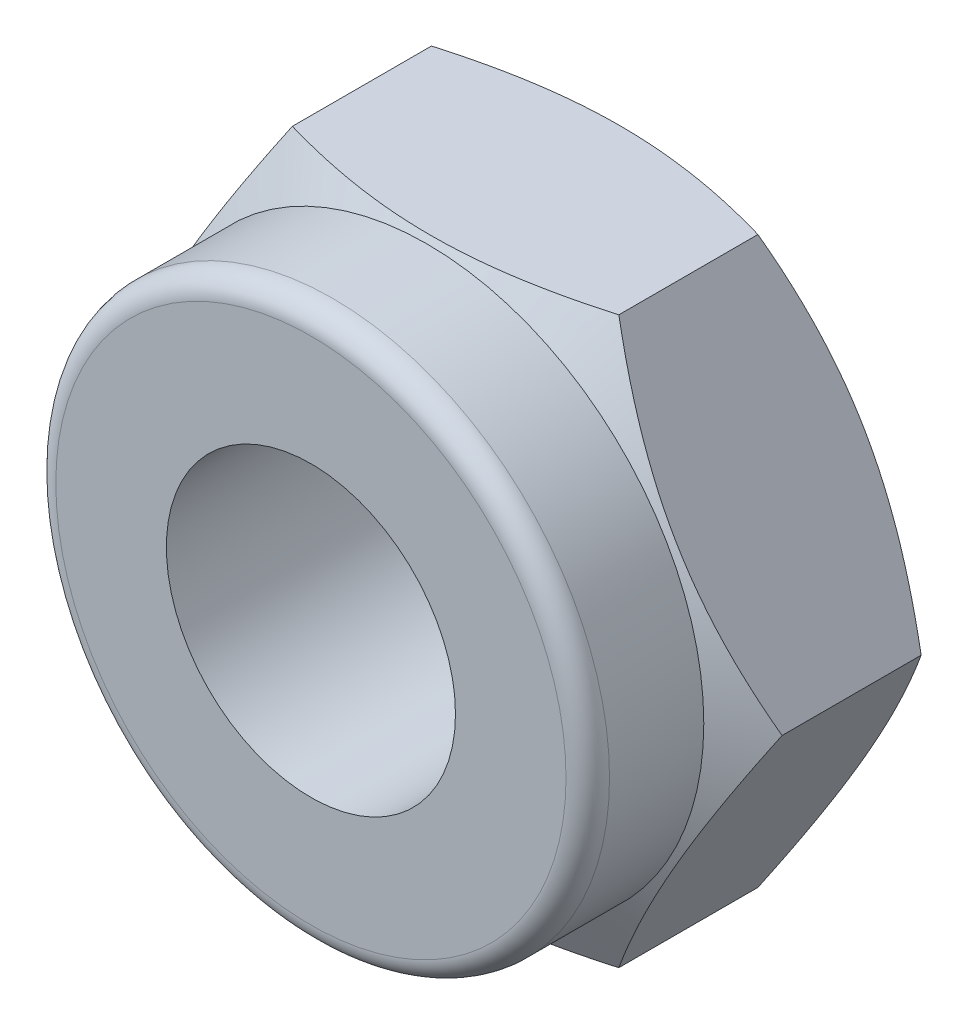
ISO-10303-21;
HEADER;
FILE_DESCRIPTION(('STEP AP214'),'2;1');
FILE_NAME('part.step','',(''),(''),'','','');
FILE_SCHEMA(('AUTOMOTIVE_DESIGN { 1 0 10303 214 1 1 1 1 }'));
ENDSEC;
DATA;
#1=APPLICATION_CONTEXT('core data for automotive mechanical design processes');
#2=APPLICATION_PROTOCOL_DEFINITION('international standard','automotive_design',2000,#1);
#3=PRODUCT_CONTEXT('',#1,'mechanical');
#4=PRODUCT('Part','Part','',(#3));
#5=PRODUCT_RELATED_PRODUCT_CATEGORY('part','',(#4));
#6=PRODUCT_DEFINITION_FORMATION('','',#4);
#7=PRODUCT_DEFINITION_CONTEXT('part definition',#1,'design');
#8=PRODUCT_DEFINITION('design','',#6,#7);
#9=PRODUCT_DEFINITION_SHAPE('','',#8);
#10=(LENGTH_UNIT() NAMED_UNIT(*) SI_UNIT(.MILLI.,.METRE.));
#11=(NAMED_UNIT(*) PLANE_ANGLE_UNIT() SI_UNIT($,.RADIAN.));
#12=(NAMED_UNIT(*) SI_UNIT($,.STERADIAN.) SOLID_ANGLE_UNIT());
#13=UNCERTAINTY_MEASURE_WITH_UNIT(LENGTH_MEASURE(1.E-05),#10,'distance_accuracy_value','');
#14=(GEOMETRIC_REPRESENTATION_CONTEXT(3) GLOBAL_UNCERTAINTY_ASSIGNED_CONTEXT((#13)) GLOBAL_UNIT_ASSIGNED_CONTEXT((#10,
#11,#12)) REPRESENTATION_CONTEXT('',''));
#15=CARTESIAN_POINT('',(0.,0.,0.));
#16=DIRECTION('',(0.,0.,1.));
#17=DIRECTION('',(1.,0.,0.));
#18=AXIS2_PLACEMENT_3D('',#15,#16,#17);
#19=CARTESIAN_POINT('',(0.,0.,4.35));
#20=DIRECTION('',(0.,0.,-1.));
#21=DIRECTION('',(-1.,0.,0.));
#22=AXIS2_PLACEMENT_3D('',#19,#20,#21);
#23=CYLINDRICAL_SURFACE('',#22,6.365);
#24=CARTESIAN_POINT('',(0.,0.,1.85));
#25=DIRECTION('',(0.,0.,1.));
#26=DIRECTION('',(1.,0.,0.));
#27=AXIS2_PLACEMENT_3D('',#24,#25,#26);
#28=CIRCLE('',#27,6.365);
#29=CARTESIAN_POINT('',(6.365,0.,1.85));
#30=VERTEX_POINT('',#29);
#31=EDGE_CURVE('E185',#30,#30,#28,.T.);
#32=ORIENTED_EDGE('',*,*,#31,.F.);
#33=EDGE_LOOP('',(#32));
#34=FACE_BOUND('',#33,.T.);
#35=CARTESIAN_POINT('',(0.,0.,-0.317542648054294));
#36=DIRECTION('',(0.,0.,-1.));
#37=DIRECTION('',(1.,0.,0.));
#38=AXIS2_PLACEMENT_3D('',#35,#36,#37);
#39=CIRCLE('',#38,6.365);
#40=CARTESIAN_POINT('',(6.365,0.,-0.317542648054294));
#41=VERTEX_POINT('',#40);
#42=EDGE_CURVE('E188',#41,#41,#39,.T.);
#43=ORIENTED_EDGE('',*,*,#42,.F.);
#44=EDGE_LOOP('',(#43));
#45=FACE_BOUND('',#44,.T.);
#46=ADVANCED_FACE('F17',(#34,#45),#23,.T.);
#47=CARTESIAN_POINT('',(0.,0.,1.85));
#48=DIRECTION('',(0.,0.,1.));
#49=DIRECTION('',(1.,0.,0.));
#50=AXIS2_PLACEMENT_3D('',#47,#48,#49);
#51=TOROIDAL_SURFACE('',#50,5.865,0.5);
#52=ORIENTED_EDGE('',*,*,#31,.T.);
#53=EDGE_LOOP('',(#52));
#54=FACE_BOUND('',#53,.T.);
#55=CARTESIAN_POINT('',(0.,0.,2.35));
#56=DIRECTION('',(0.,0.,-1.));
#57=DIRECTION('',(1.,0.,0.));
#58=AXIS2_PLACEMENT_3D('',#55,#56,#57);
#59=CIRCLE('',#58,5.865);
#60=CARTESIAN_POINT('',(-5.865,0.,2.35));
#61=VERTEX_POINT('',#60);
#62=CARTESIAN_POINT('',(5.865,0.,2.35));
#63=VERTEX_POINT('',#62);
#64=EDGE_CURVE('E75',#61,#63,#59,.F.);
#65=ORIENTED_EDGE('',*,*,#64,.F.);
#66=CARTESIAN_POINT('',(0.,0.,2.35));
#67=DIRECTION('',(0.,0.,-1.));
#68=DIRECTION('',(-1.,0.,0.));
#69=AXIS2_PLACEMENT_3D('',#66,#67,#68);
#70=CIRCLE('',#69,5.865);
#71=EDGE_CURVE('E191',#63,#61,#70,.F.);
#72=ORIENTED_EDGE('',*,*,#71,.F.);
#73=EDGE_LOOP('',(#65,#72));
#74=FACE_BOUND('',#73,.T.);
#75=ADVANCED_FACE('F108',(#54,#74),#51,.T.);
#76=CARTESIAN_POINT('',(0.,0.,-0.97999251121531));
#77=DIRECTION('',(0.,0.,-1.));
#78=DIRECTION('',(-1.,0.,0.));
#79=AXIS2_PLACEMENT_3D('',#76,#77,#78);
#80=CONICAL_SURFACE('',#79,7.51239682046193,1.0471975511966);
#81=CARTESIAN_POINT('',(7.50555349946514,0.,-0.976041517995662));
#82=CARTESIAN_POINT('',(7.42306413225731,-0.142875775088176,-0.928425447547227));
#83=CARTESIAN_POINT('',(7.34026720585395,-0.286284258329331,-0.882970550055043));
#84=CARTESIAN_POINT('',(7.17400096468323,-0.574265835620523,-0.796978304075957));
#85=CARTESIAN_POINT('',(7.09053137629194,-0.718839403601101,-0.756443076940983));
#86=CARTESIAN_POINT('',(6.83878625276799,-1.15487474810228,-0.643012619628592));
#87=CARTESIAN_POINT('',(6.66951702604567,-1.44805764894324,-0.578495682867198));
#88=CARTESIAN_POINT('',(6.41620872846852,-1.88680049032564,-0.502843782974544));
#89=CARTESIAN_POINT('',(6.33292644227507,-2.03104964138317,-0.48129310542054));
#90=CARTESIAN_POINT('',(6.16598561364301,-2.32019963843156,-0.445156633633839));
#91=CARTESIAN_POINT('',(6.08232710510691,-2.46510042570152,-0.430570224040223));
#92=CARTESIAN_POINT('',(5.91486483881928,-2.75515357926232,-0.408734025939752));
#93=CARTESIAN_POINT('',(5.83106135447214,-2.90030547200287,-0.401475912268133));
#94=CARTESIAN_POINT('',(5.66338165892069,-3.19073522409566,-0.394444145267347));
#95=CARTESIAN_POINT('',(5.57950545004408,-3.33601307941621,-0.394670260634795));
#96=CARTESIAN_POINT('',(5.34972638911939,-3.73400208745323,-0.405576488157031));
#97=CARTESIAN_POINT('',(5.20389879784904,-3.98658288467888,-0.423875958247116));
#98=CARTESIAN_POINT('',(4.91321216353889,-4.49006690438526,-0.481897477157326));
#99=CARTESIAN_POINT('',(4.76835414237743,-4.74096835692078,-0.521639346886367));
#100=CARTESIAN_POINT('',(4.47708276744823,-5.24546517708861,-0.620980029139186));
#101=CARTESIAN_POINT('',(4.33070615631823,-5.49899690460551,-0.680999630839513));
#102=CARTESIAN_POINT('',(4.04013550251678,-6.00228004017814,-0.817218966611441));
#103=CARTESIAN_POINT('',(3.89593774018532,-6.25203789087397,-0.893386714735364));
#104=CARTESIAN_POINT('',(3.75277674973258,-6.5,-0.976041517995661));
#105=B_SPLINE_CURVE_WITH_KNOTS('',3,(#81,#82,#83,#84,#85,#86,#87,#88,#89,#90,#91,#92,#93,#94,
#95,#96,#97,#98,#99,#100,#101,#102,#103,#104),.UNSPECIFIED.,.F.,.F.,(4,2,2,2,2,2,2,2,2,2,2,4),
(0.,0.515097151807923,1.03041562924707,2.0631934970254,2.56693469263121,3.07063136955385,
3.57375518587235,4.07686345294286,4.95263085757859,5.82920919385675,6.72522583711309,
7.61948397794854),.UNSPECIFIED.);
#106=CARTESIAN_POINT('',(7.50555349946513,0.,-0.976041517995657));
#107=VERTEX_POINT('',#106);
#108=CARTESIAN_POINT('',(3.75277674973258,-6.5,-0.976041517995662));
#109=VERTEX_POINT('',#108);
#110=EDGE_CURVE('E64',#107,#109,#105,.T.);
#111=ORIENTED_EDGE('',*,*,#110,.F.);
#112=CARTESIAN_POINT('',(3.75277674973256,6.5,-0.976041517995656));
#113=CARTESIAN_POINT('',(3.83526611694039,6.35712422491183,-0.928425447547222));
#114=CARTESIAN_POINT('',(3.91806304334374,6.21371574167068,-0.882970550055038));
#115=CARTESIAN_POINT('',(4.08432928451447,5.92573416437948,-0.796978304075951));
#116=CARTESIAN_POINT('',(4.16779887290576,5.78116059639891,-0.756443076940976));
#117=CARTESIAN_POINT('',(4.4195439964297,5.34512525189773,-0.643012619628585));
#118=CARTESIAN_POINT('',(4.58881322315202,5.05194235105677,-0.57849568286719));
#119=CARTESIAN_POINT('',(4.84212152072918,4.61319950967437,-0.502843782974536));
#120=CARTESIAN_POINT('',(4.92540380692262,4.46895035861684,-0.481293105420532));
#121=CARTESIAN_POINT('',(5.09234463555468,4.17980036156845,-0.445156633633831));
#122=CARTESIAN_POINT('',(5.17600314409078,4.03489957429849,-0.430570224040214));
#123=CARTESIAN_POINT('',(5.34346541037841,3.74484642073769,-0.408734025939743));
#124=CARTESIAN_POINT('',(5.42726889472555,3.59969452799714,-0.401475912268124));
#125=CARTESIAN_POINT('',(5.594948590277,3.30926477590435,-0.394444145267338));
#126=CARTESIAN_POINT('',(5.67882479915361,3.16398692058381,-0.394670260634785));
#127=CARTESIAN_POINT('',(5.9086038600783,2.76599791254678,-0.40557648815702));
#128=CARTESIAN_POINT('',(6.05443145134866,2.51341711532113,-0.423875958247104));
#129=CARTESIAN_POINT('',(6.34511808565881,2.00993309561475,-0.481897477157315));
#130=CARTESIAN_POINT('',(6.48997610682026,1.75903164307923,-0.521639346886356));
#131=CARTESIAN_POINT('',(6.78124748174947,1.25453482291139,-0.620980029139175));
#132=CARTESIAN_POINT('',(6.92762409287947,1.00100309539449,-0.680999630839503));
#133=CARTESIAN_POINT('',(7.21819474668093,0.497719959821852,-0.817218966611432));
#134=CARTESIAN_POINT('',(7.36239250901238,0.247962109126026,-0.893386714735356));
#135=CARTESIAN_POINT('',(7.50555349946513,0.,-0.976041517995654));
#136=B_SPLINE_CURVE_WITH_KNOTS('',3,(#112,#113,#114,#115,#116,#117,#118,#119,#120,#121,#122,
#123,#124,#125,#126,#127,#128,#129,#130,#131,#132,#133,#134,#135),.UNSPECIFIED.,.F.,.F.,(4,2,2,
2,2,2,2,2,2,2,2,4),(0.,0.515097151807923,1.03041562924707,2.06319349702539,2.5669346926312,
3.07063136955385,3.57375518587234,4.07686345294285,4.95263085757859,5.82920919385676,
6.72522583711311,7.61948397794856),.UNSPECIFIED.);
#137=CARTESIAN_POINT('',(3.75277674973256,6.5,-0.976041517995657));
#138=VERTEX_POINT('',#137);
#139=EDGE_CURVE('E69',#138,#107,#136,.T.);
#140=ORIENTED_EDGE('',*,*,#139,.F.);
#141=CARTESIAN_POINT('',(-3.75277674973256,6.5,-0.976041517995659));
#142=CARTESIAN_POINT('',(-3.5877980153169,6.5,-0.928425447547224));
#143=CARTESIAN_POINT('',(-3.42220416251019,6.5,-0.882970550055041));
#144=CARTESIAN_POINT('',(-3.08967168016874,6.5,-0.796978304075955));
#145=CARTESIAN_POINT('',(-2.92273250338616,6.5,-0.75644307694098));
#146=CARTESIAN_POINT('',(-2.41924225633827,6.5,-0.64301261962859));
#147=CARTESIAN_POINT('',(-2.08070380289362,6.5,-0.578495682867194));
#148=CARTESIAN_POINT('',(-1.57408720773932,6.5,-0.502843782974541));
#149=CARTESIAN_POINT('',(-1.40752263535244,6.5,-0.481293105420537));
#150=CARTESIAN_POINT('',(-1.07364097808831,6.5,-0.445156633633837));
#151=CARTESIAN_POINT('',(-0.906323961016103,6.5,-0.43057022404022));
#152=CARTESIAN_POINT('',(-0.57139942844085,6.5,-0.408734025939749));
#153=CARTESIAN_POINT('',(-0.40379245974657,6.5,-0.40147591226813));
#154=CARTESIAN_POINT('',(-0.0684330686436741,6.5,-0.394444145267344));
#155=CARTESIAN_POINT('',(0.0993193491095459,6.5,-0.394670260634792));
#156=CARTESIAN_POINT('',(0.558877470958923,6.5,-0.405576488157028));
#157=CARTESIAN_POINT('',(0.850532653499638,6.5,-0.423875958247112));
#158=CARTESIAN_POINT('',(1.43190592211994,6.5,-0.481897477157322));
#159=CARTESIAN_POINT('',(1.72162196444284,6.5,-0.521639346886363));
#160=CARTESIAN_POINT('',(2.30416471430125,6.5,-0.620980029139182));
#161=CARTESIAN_POINT('',(2.59691793656125,6.5,-0.680999630839509));
#162=CARTESIAN_POINT('',(3.17805924416416,6.5,-0.817218966611437));
#163=CARTESIAN_POINT('',(3.46645476882707,6.5,-0.89338671473536));
#164=CARTESIAN_POINT('',(3.75277674973256,6.5,-0.976041517995657));
#165=B_SPLINE_CURVE_WITH_KNOTS('',3,(#141,#142,#143,#144,#145,#146,#147,#148,#149,#150,#151,
#152,#153,#154,#155,#156,#157,#158,#159,#160,#161,#162,#163,#164),.UNSPECIFIED.,.F.,.F.,(4,2,2,
2,2,2,2,2,2,2,2,4),(0.,0.515097151807923,1.03041562924707,2.06319349702539,2.56693469263121,
3.07063136955385,3.57375518587235,4.07686345294286,4.95263085757859,5.82920919385675,
6.72522583711309,7.61948397794854),.UNSPECIFIED.);
#166=CARTESIAN_POINT('',(-3.75277674973256,6.5,-0.976041517995659));
#167=VERTEX_POINT('',#166);
#168=EDGE_CURVE('E87',#167,#138,#165,.T.);
#169=ORIENTED_EDGE('',*,*,#168,.F.);
#170=CARTESIAN_POINT('',(-7.50555349946513,0.,-0.976041517995657));
#171=CARTESIAN_POINT('',(-7.4230641322573,0.14287577508817,-0.928425447547223));
#172=CARTESIAN_POINT('',(-7.34026720585394,0.286284258329325,-0.882970550055039));
#173=CARTESIAN_POINT('',(-7.17400096468322,0.574265835620517,-0.796978304075953));
#174=CARTESIAN_POINT('',(-7.09053137629193,0.718839403601094,-0.756443076940978));
#175=CARTESIAN_POINT('',(-6.83878625276799,1.15487474810227,-0.643012619628588));
#176=CARTESIAN_POINT('',(-6.66951702604566,1.44805764894323,-0.578495682867193));
#177=CARTESIAN_POINT('',(-6.41620872846851,1.88680049032563,-0.502843782974539));
#178=CARTESIAN_POINT('',(-6.33292644227507,2.03104964138316,-0.481293105420536));
#179=CARTESIAN_POINT('',(-6.165985613643,2.32019963843155,-0.445156633633835));
#180=CARTESIAN_POINT('',(-6.0823271051069,2.46510042570151,-0.430570224040218));
#181=CARTESIAN_POINT('',(-5.91486483881928,2.75515357926231,-0.408734025939748));
#182=CARTESIAN_POINT('',(-5.83106135447214,2.90030547200286,-0.401475912268128));
#183=CARTESIAN_POINT('',(-5.66338165892069,3.19073522409565,-0.394444145267342));
#184=CARTESIAN_POINT('',(-5.57950545004408,3.3360130794162,-0.394670260634789));
#185=CARTESIAN_POINT('',(-5.34972638911939,3.73400208745322,-0.405576488157025));
#186=CARTESIAN_POINT('',(-5.20389879784903,3.98658288467887,-0.42387595824711));
#187=CARTESIAN_POINT('',(-4.91321216353888,4.49006690438525,-0.481897477157321));
#188=CARTESIAN_POINT('',(-4.76835414237743,4.74096835692077,-0.521639346886362));
#189=CARTESIAN_POINT('',(-4.47708276744822,5.2454651770886,-0.620980029139181));
#190=CARTESIAN_POINT('',(-4.33070615631822,5.49899690460551,-0.680999630839509));
#191=CARTESIAN_POINT('',(-4.04013550251676,6.00228004017814,-0.817218966611438));
#192=CARTESIAN_POINT('',(-3.89593774018531,6.25203789087397,-0.893386714735362));
#193=CARTESIAN_POINT('',(-3.75277674973256,6.5,-0.976041517995659));
#194=B_SPLINE_CURVE_WITH_KNOTS('',3,(#170,#171,#172,#173,#174,#175,#176,#177,#178,#179,#180,
#181,#182,#183,#184,#185,#186,#187,#188,#189,#190,#191,#192,#193),.UNSPECIFIED.,.F.,.F.,(4,2,2,
2,2,2,2,2,2,2,2,4),(0.,0.515097151807923,1.03041562924707,2.06319349702539,2.56693469263121,
3.07063136955385,3.57375518587235,4.07686345294286,4.95263085757859,5.82920919385676,
6.7252258371131,7.61948397794855),.UNSPECIFIED.);
#195=CARTESIAN_POINT('',(-7.50555349946513,0.,-0.976041517995656));
#196=VERTEX_POINT('',#195);
#197=EDGE_CURVE('E234',#196,#167,#194,.T.);
#198=ORIENTED_EDGE('',*,*,#197,.F.);
#199=CARTESIAN_POINT('',(-3.75277674973256,-6.5,-0.976041517995658));
#200=CARTESIAN_POINT('',(-3.83526611694039,-6.35712422491183,-0.928425447547224));
#201=CARTESIAN_POINT('',(-3.91806304334374,-6.21371574167068,-0.88297055005504));
#202=CARTESIAN_POINT('',(-4.08432928451447,-5.92573416437949,-0.796978304075952));
#203=CARTESIAN_POINT('',(-4.16779887290576,-5.78116059639891,-0.756443076940977));
#204=CARTESIAN_POINT('',(-4.4195439964297,-5.34512525189773,-0.643012619628585));
#205=CARTESIAN_POINT('',(-4.58881322315203,-5.05194235105677,-0.578495682867191));
#206=CARTESIAN_POINT('',(-4.84212152072918,-4.61319950967437,-0.502843782974538));
#207=CARTESIAN_POINT('',(-4.92540380692262,-4.46895035861684,-0.481293105420534));
#208=CARTESIAN_POINT('',(-5.09234463555468,-4.17980036156845,-0.445156633633833));
#209=CARTESIAN_POINT('',(-5.17600314409079,-4.03489957429849,-0.430570224040216));
#210=CARTESIAN_POINT('',(-5.34346541037841,-3.74484642073769,-0.408734025939745));
#211=CARTESIAN_POINT('',(-5.42726889472555,-3.59969452799714,-0.401475912268125));
#212=CARTESIAN_POINT('',(-5.594948590277,-3.30926477590435,-0.394444145267339));
#213=CARTESIAN_POINT('',(-5.67882479915361,-3.1639869205838,-0.394670260634786));
#214=CARTESIAN_POINT('',(-5.9086038600783,-2.76599791254678,-0.405576488157022));
#215=CARTESIAN_POINT('',(-6.05443145134866,-2.51341711532113,-0.423875958247106));
#216=CARTESIAN_POINT('',(-6.34511808565881,-2.00993309561475,-0.481897477157316));
#217=CARTESIAN_POINT('',(-6.48997610682026,-1.75903164307923,-0.521639346886357));
#218=CARTESIAN_POINT('',(-6.78124748174947,-1.2545348229114,-0.620980029139176));
#219=CARTESIAN_POINT('',(-6.92762409287947,-1.00100309539449,-0.680999630839504));
#220=CARTESIAN_POINT('',(-7.21819474668093,-0.497719959821857,-0.817218966611433));
#221=CARTESIAN_POINT('',(-7.36239250901238,-0.247962109126032,-0.893386714735357));
#222=CARTESIAN_POINT('',(-7.50555349946513,0.,-0.976041517995654));
#223=B_SPLINE_CURVE_WITH_KNOTS('',3,(#199,#200,#201,#202,#203,#204,#205,#206,#207,#208,#209,
#210,#211,#212,#213,#214,#215,#216,#217,#218,#219,#220,#221,#222),.UNSPECIFIED.,.F.,.F.,(4,2,2,
2,2,2,2,2,2,2,2,4),(0.,0.515097151807923,1.03041562924707,2.06319349702539,2.56693469263121,
3.07063136955385,3.57375518587235,4.07686345294285,4.95263085757859,5.82920919385676,
6.7252258371131,7.61948397794856),.UNSPECIFIED.);
#224=CARTESIAN_POINT('',(-3.75277674973256,-6.5,-0.976041517995657));
#225=VERTEX_POINT('',#224);
#226=EDGE_CURVE('E118',#225,#196,#223,.T.);
#227=ORIENTED_EDGE('',*,*,#226,.F.);
#228=CARTESIAN_POINT('',(3.75277674973257,-6.5,-0.976041517995663));
#229=CARTESIAN_POINT('',(3.58779801531691,-6.5,-0.928425447547228));
#230=CARTESIAN_POINT('',(3.4222041625102,-6.5,-0.882970550055044));
#231=CARTESIAN_POINT('',(3.08967168016875,-6.5,-0.796978304075957));
#232=CARTESIAN_POINT('',(2.92273250338617,-6.5,-0.756443076940983));
#233=CARTESIAN_POINT('',(2.41924225633828,-6.5,-0.643012619628591));
#234=CARTESIAN_POINT('',(2.08070380289363,-6.5,-0.578495682867196));
#235=CARTESIAN_POINT('',(1.57408720773933,-6.5,-0.502843782974542));
#236=CARTESIAN_POINT('',(1.40752263535245,-6.5,-0.481293105420539));
#237=CARTESIAN_POINT('',(1.07364097808832,-6.5,-0.445156633633838));
#238=CARTESIAN_POINT('',(0.906323961016112,-6.5,-0.430570224040221));
#239=CARTESIAN_POINT('',(0.571399428440859,-6.5,-0.40873402593975));
#240=CARTESIAN_POINT('',(0.403792459746578,-6.5,-0.40147591226813));
#241=CARTESIAN_POINT('',(0.0684330686436822,-6.5,-0.394444145267344));
#242=CARTESIAN_POINT('',(-0.0993193491095378,-6.5,-0.394670260634792));
#243=CARTESIAN_POINT('',(-0.558877470958916,-6.5,-0.405576488157028));
#244=CARTESIAN_POINT('',(-0.850532653499632,-6.5,-0.423875958247112));
#245=CARTESIAN_POINT('',(-1.43190592211993,-6.5,-0.481897477157322));
#246=CARTESIAN_POINT('',(-1.72162196444284,-6.5,-0.521639346886363));
#247=CARTESIAN_POINT('',(-2.30416471430125,-6.5,-0.620980029139181));
#248=CARTESIAN_POINT('',(-2.59691793656124,-6.5,-0.680999630839508));
#249=CARTESIAN_POINT('',(-3.17805924416416,-6.5,-0.817218966611435));
#250=CARTESIAN_POINT('',(-3.46645476882707,-6.5,-0.893386714735359));
#251=CARTESIAN_POINT('',(-3.75277674973256,-6.5,-0.976041517995657));
#252=B_SPLINE_CURVE_WITH_KNOTS('',3,(#228,#229,#230,#231,#232,#233,#234,#235,#236,#237,#238,
#239,#240,#241,#242,#243,#244,#245,#246,#247,#248,#249,#250,#251),.UNSPECIFIED.,.F.,.F.,(4,2,2,
2,2,2,2,2,2,2,2,4),(0.,0.515097151807923,1.03041562924707,2.0631934970254,2.56693469263121,
3.07063136955385,3.57375518587235,4.07686345294286,4.95263085757859,5.82920919385676,
6.7252258371131,7.61948397794855),.UNSPECIFIED.);
#253=EDGE_CURVE('E72',#109,#225,#252,.T.);
#254=ORIENTED_EDGE('',*,*,#253,.F.);
#255=EDGE_LOOP('',(#111,#140,#169,#198,#227,#254));
#256=FACE_BOUND('',#255,.T.);
#257=ORIENTED_EDGE('',*,*,#42,.T.);
#258=EDGE_LOOP('',(#257));
#259=FACE_BOUND('',#258,.T.);
#260=ADVANCED_FACE('F65',(#256,#259),#80,.T.);
#261=CARTESIAN_POINT('',(0.,0.,2.35));
#262=DIRECTION('',(0.,0.,1.));
#263=DIRECTION('',(1.,0.,0.));
#264=AXIS2_PLACEMENT_3D('',#261,#262,#263);
#265=PLANE('',#264);
#266=CARTESIAN_POINT('',(0.,0.,2.35));
#267=DIRECTION('',(0.,0.,1.));
#268=DIRECTION('',(1.,0.,0.));
#269=AXIS2_PLACEMENT_3D('',#266,#267,#268);
#270=CIRCLE('',#269,3.3235);
#271=CARTESIAN_POINT('',(3.3235,0.,2.35));
#272=VERTEX_POINT('',#271);
#273=EDGE_CURVE('E82',#272,#272,#270,.F.);
#274=ORIENTED_EDGE('',*,*,#273,.T.);
#275=EDGE_LOOP('',(#274));
#276=FACE_BOUND('',#275,.T.);
#277=ORIENTED_EDGE('',*,*,#71,.T.);
#278=ORIENTED_EDGE('',*,*,#64,.T.);
#279=EDGE_LOOP('',(#277,#278));
#280=FACE_BOUND('',#279,.T.);
#281=ADVANCED_FACE('F107',(#276,#280),#265,.T.);
#282=CARTESIAN_POINT('',(3.75277674973258,-6.5,-5.15));
#283=DIRECTION('',(0.866025403784439,-0.5,0.));
#284=DIRECTION('',(0.5,0.866025403784439,0.));
#285=AXIS2_PLACEMENT_3D('',#282,#283,#284);
#286=PLANE('',#285);
#287=DIRECTION('',(0.,0.,-1.));
#288=VECTOR('',#287,1.);
#289=CARTESIAN_POINT('',(3.75277674973258,-6.5,-5.15));
#290=LINE('',#289,#288);
#291=CARTESIAN_POINT('',(3.75277676639756,-6.5,-4.17395847719851));
#292=VERTEX_POINT('',#291);
#293=EDGE_CURVE('E74',#292,#109,#290,.F.);
#294=ORIENTED_EDGE('',*,*,#293,.F.);
#295=CARTESIAN_POINT('',(7.5055534994611,-7.00308469126436E-12,-4.17395848201161));
#296=CARTESIAN_POINT('',(7.42306413226044,-0.142875775082739,-4.22157455245497));
#297=CARTESIAN_POINT('',(7.34026720586433,-0.286284258311354,-4.26702944994249));
#298=CARTESIAN_POINT('',(7.17400096470823,-0.574265835577209,-4.35302169591321));
#299=CARTESIAN_POINT('',(7.09053137632433,-0.71883940354499,-4.39355692304449));
#300=CARTESIAN_POINT('',(6.83878625282459,-1.15487474800424,-4.50698738034673));
#301=CARTESIAN_POINT('',(6.66951702611933,-1.44805764881566,-4.57150431710366));
#302=CARTESIAN_POINT('',(6.4162087285524,-1.88680049018035,-4.64715621699928));
#303=CARTESIAN_POINT('',(6.33292644235192,-2.03104964125008,-4.66870689455695));
#304=CARTESIAN_POINT('',(6.16598561370569,-2.320199638323,-4.70484336634996));
#305=CARTESIAN_POINT('',(6.08232710516246,-2.46510042560531,-4.71942977594624));
#306=CARTESIAN_POINT('',(5.91486483885972,-2.75515357919228,-4.7412659740512));
#307=CARTESIAN_POINT('',(5.83106135450459,-2.90030547194666,-4.74852408772457));
#308=CARTESIAN_POINT('',(5.66338165893724,-3.190735224067,-4.75555585472706));
#309=CARTESIAN_POINT('',(5.57950545005271,-3.33601307940126,-4.75532973935959));
#310=CARTESIAN_POINT('',(5.34972639277594,-3.73400208111991,-4.74442351201218));
#311=CARTESIAN_POINT('',(5.20389880515664,-3.98658287202175,-4.72612404266922));
#312=CARTESIAN_POINT('',(4.91321217808701,-4.49006687918717,-4.66810252628159));
#313=CARTESIAN_POINT('',(4.76835416051488,-4.7409683255058,-4.62836065833044));
#314=CARTESIAN_POINT('',(4.47708279284768,-5.24546513309547,-4.52901998051057));
#315=CARTESIAN_POINT('',(4.33070618538681,-5.49899685425726,-4.4690003814974));
#316=CARTESIAN_POINT('',(4.04013553879003,-6.00227997735102,-4.33278105168422));
#317=CARTESIAN_POINT('',(3.89593777999461,-6.25203782192225,-4.25661330682833));
#318=CARTESIAN_POINT('',(3.75277679302817,-6.49999992500984,-4.173958507006));
#319=B_SPLINE_CURVE_WITH_KNOTS('',3,(#295,#296,#297,#298,#299,#300,#301,#302,#303,#304,#305,
#306,#307,#308,#309,#310,#311,#312,#313,#314,#315,#316,#317,#318),.UNSPECIFIED.,.F.,.F.,(4,2,2,
2,2,2,2,2,2,2,2,4),(0.,0.515097151762339,1.03041562915581,2.06319349683153,2.56693469248062,
3.07063136944647,3.5737551858133,4.07686345293021,4.95263083563277,5.82920914989659,
6.72522576999469,7.6194838878483),.UNSPECIFIED.);
#320=CARTESIAN_POINT('',(7.50555349949747,0.,-4.17395848200038));
#321=VERTEX_POINT('',#320);
#322=EDGE_CURVE('E36',#321,#292,#319,.T.);
#323=ORIENTED_EDGE('',*,*,#322,.F.);
#324=DIRECTION('',(0.,0.,1.));
#325=VECTOR('',#324,1.);
#326=CARTESIAN_POINT('',(7.50555349946513,0.,-5.15));
#327=LINE('',#326,#325);
#328=EDGE_CURVE('E77',#107,#321,#327,.F.);
#329=ORIENTED_EDGE('',*,*,#328,.F.);
#330=ORIENTED_EDGE('',*,*,#110,.T.);
#331=EDGE_LOOP('',(#294,#323,#329,#330));
#332=FACE_BOUND('',#331,.T.);
#333=ADVANCED_FACE('F78',(#332),#286,.T.);
#334=CARTESIAN_POINT('',(-3.75277674973256,-6.5,-5.15));
#335=DIRECTION('',(0.,-1.,0.));
#336=DIRECTION('',(0.,0.,-1.));
#337=AXIS2_PLACEMENT_3D('',#334,#335,#336);
#338=PLANE('',#337);
#339=DIRECTION('',(0.,0.,1.));
#340=VECTOR('',#339,1.);
#341=CARTESIAN_POINT('',(-3.75277674973256,-6.5,-5.15));
#342=LINE('',#341,#340);
#343=CARTESIAN_POINT('',(-3.75277674139978,-6.5000000144328,-4.17395847719835));
#344=VERTEX_POINT('',#343);
#345=EDGE_CURVE('E132',#344,#225,#342,.T.);
#346=ORIENTED_EDGE('',*,*,#345,.F.);
#347=CARTESIAN_POINT('',(3.75277678306254,-6.5,-4.17395847238775));
#348=CARTESIAN_POINT('',(3.58779804838594,-6.5,-4.22157454322773));
#349=CARTESIAN_POINT('',(3.42220419531707,-6.5,-4.26702944112164));
#350=CARTESIAN_POINT('',(3.08967171244588,-6.5,-4.3530216879232));
#351=CARTESIAN_POINT('',(2.92273253539569,-6.5,-4.39355691547892));
#352=CARTESIAN_POINT('',(2.41924228751765,-6.5,-4.5069873740845));
#353=CARTESIAN_POINT('',(2.08070383349787,-6.5,-4.57150431174356));
#354=CARTESIAN_POINT('',(1.57408723743433,-6.5,-4.64715621298692));
#355=CARTESIAN_POINT('',(1.40752266473778,-6.5,-4.6687068909864));
#356=CARTESIAN_POINT('',(1.07364100683674,-6.5,-4.70484336365841));
#357=CARTESIAN_POINT('',(0.906323989437311,-6.5,-4.71942977369187));
#358=CARTESIAN_POINT('',(0.571399456190159,-6.5,-4.74126597265532));
#359=CARTESIAN_POINT('',(0.403792487151232,-6.5,-4.74852408675015));
#360=CARTESIAN_POINT('',(0.0684330953407197,-6.5,-4.75555585456964));
#361=CARTESIAN_POINT('',(-0.0993193227754698,-6.5,-4.75532973959772));
#362=CARTESIAN_POINT('',(-0.558877439803717,-6.5,-4.74442351324807));
#363=CARTESIAN_POINT('',(-0.850532617185107,-6.5,-4.72612404435291));
#364=CARTESIAN_POINT('',(-1.43190587561644,-6.5,-4.66810252850229));
#365=CARTESIAN_POINT('',(-1.72162191290994,-6.5,-4.62836066063956));
#366=CARTESIAN_POINT('',(-2.30416465261939,-6.5,-4.5290199826661));
#367=CARTESIAN_POINT('',(-2.59691786976532,-6.5,-4.46900038339938));
#368=CARTESIAN_POINT('',(-3.17805916733875,-6.5,-4.33278105281471));
#369=CARTESIAN_POINT('',(-3.46645468708551,-6.5,-4.25661330744193));
#370=CARTESIAN_POINT('',(-3.75277666314028,-6.5,-4.17395850700632));
#371=B_SPLINE_CURVE_WITH_KNOTS('',3,(#347,#348,#349,#350,#351,#352,#353,#354,#355,#356,#357,
#358,#359,#360,#361,#362,#363,#364,#365,#366,#367,#368,#369,#370),.UNSPECIFIED.,.F.,.F.,(4,2,2,
2,2,2,2,2,2,2,2,4),(0.,0.515097152885971,1.03041563140371,2.06319350138647,2.56693469808512,
3.07063137610016,3.57375519350606,4.07686346166217,4.95263085067335,5.82920917127014,
6.72522579804451,7.61948392253173),.UNSPECIFIED.);
#372=EDGE_CURVE('E143',#292,#344,#371,.T.);
#373=ORIENTED_EDGE('',*,*,#372,.F.);
#374=ORIENTED_EDGE('',*,*,#293,.T.);
#375=ORIENTED_EDGE('',*,*,#253,.T.);
#376=EDGE_LOOP('',(#346,#373,#374,#375));
#377=FACE_BOUND('',#376,.T.);
#378=ADVANCED_FACE('F133',(#377),#338,.T.);
#379=CARTESIAN_POINT('',(-7.50555349946513,0.,-5.15));
#380=DIRECTION('',(-0.866025403784439,-0.5,0.));
#381=DIRECTION('',(0.5,-0.866025403784439,0.));
#382=AXIS2_PLACEMENT_3D('',#379,#380,#381);
#383=PLANE('',#382);
#384=DIRECTION('',(0.,0.,1.));
#385=VECTOR('',#384,1.);
#386=CARTESIAN_POINT('',(-7.50555349946513,0.,-5.15));
#387=LINE('',#386,#385);
#388=CARTESIAN_POINT('',(-7.50555349943801,0.,-4.17395848203379));
#389=VERTEX_POINT('',#388);
#390=EDGE_CURVE('E231',#389,#196,#387,.T.);
#391=ORIENTED_EDGE('',*,*,#390,.F.);
#392=CARTESIAN_POINT('',(-3.752776733067,-6.5000000288656,-4.17395847238742));
#393=CARTESIAN_POINT('',(-3.83526610041231,-6.3571242535393,-4.22157454323146));
#394=CARTESIAN_POINT('',(-3.91806302695381,-6.21371577005887,-4.26702944112906));
#395=CARTESIAN_POINT('',(-4.08432926840367,-5.9257341922842,-4.35302168793712));
#396=CARTESIAN_POINT('',(-4.16779885693595,-5.78116062405942,-4.39355691549566));
#397=CARTESIAN_POINT('',(-4.41954398089852,-5.34512527879852,-4.5069873741089));
#398=CARTESIAN_POINT('',(-4.58881320792497,-5.0519423774308,-4.57150431177098));
#399=CARTESIAN_POINT('',(-4.84212150596625,-4.61319953524451,-4.64715621300974));
#400=CARTESIAN_POINT('',(-4.9254037923073,-4.46895038393132,-4.6687068910051));
#401=CARTESIAN_POINT('',(-5.09234462124325,-4.17980038635659,-4.70484336367005));
#402=CARTESIAN_POINT('',(-5.17600312993563,-4.03489959881594,-4.71942977370055));
#403=CARTESIAN_POINT('',(-5.34346539654368,-3.74484644470016,-4.74126597265909));
#404=CARTESIAN_POINT('',(-5.42726888105494,-3.59969455167533,-4.74852408675204));
#405=CARTESIAN_POINT('',(-5.59494857694387,-3.30926479899802,-4.75555585456974));
#406=CARTESIAN_POINT('',(-5.67882478599383,-3.16398694337721,-4.75532973959787));
#407=CARTESIAN_POINT('',(-5.90860384815547,-2.76599793319772,-4.74442351307375));
#408=CARTESIAN_POINT('',(-6.05443144049704,-2.51341713411668,-4.72612404343191));
#409=CARTESIAN_POINT('',(-6.3451180769529,-2.00993311069382,-4.66810252506002));
#410=CARTESIAN_POINT('',(-6.48997609918883,-1.75903165629725,-4.62836065542026));
#411=CARTESIAN_POINT('',(-6.78124747630522,-1.25453483234112,-4.52901997301599));
#412=CARTESIAN_POINT('',(-6.92762408854711,-1.00100310289835,-4.46900037106339));
#413=CARTESIAN_POINT('',(-7.21819474453819,-0.497719963533187,-4.3327810345228));
#414=CARTESIAN_POINT('',(-7.36239250794748,-0.247962110970489,-4.25661328588355));
#415=CARTESIAN_POINT('',(-7.50555349946109,-6.99262702393653E-12,-4.17395848201162));
#416=B_SPLINE_CURVE_WITH_KNOTS('',3,(#392,#393,#394,#395,#396,#397,#398,#399,#400,#401,#402,
#403,#404,#405,#406,#407,#408,#409,#410,#411,#412,#413,#414,#415),.UNSPECIFIED.,.F.,.F.,(4,2,2,
2,2,2,2,2,2,2,2,4),(0.,0.515097152929786,1.03041563149142,2.06319350157311,2.56693469822717,
3.0706313761977,3.57375519355399,4.07686346166242,4.95263087260564,5.8292092152156,
6.72522586514627,7.61948401261348),.UNSPECIFIED.);
#417=EDGE_CURVE('E150',#344,#389,#416,.T.);
#418=ORIENTED_EDGE('',*,*,#417,.F.);
#419=ORIENTED_EDGE('',*,*,#345,.T.);
#420=ORIENTED_EDGE('',*,*,#226,.T.);
#421=EDGE_LOOP('',(#391,#418,#419,#420));
#422=FACE_BOUND('',#421,.T.);
#423=ADVANCED_FACE('F136',(#422),#383,.T.);
#424=CARTESIAN_POINT('',(-3.75277674973256,6.5,-5.15));
#425=DIRECTION('',(-0.866025403784439,0.5,0.));
#426=DIRECTION('',(-0.5,-0.866025403784439,0.));
#427=AXIS2_PLACEMENT_3D('',#424,#425,#426);
#428=PLANE('',#427);
#429=DIRECTION('',(0.,0.,1.));
#430=VECTOR('',#429,1.);
#431=CARTESIAN_POINT('',(-3.75277674973256,6.5,-5.15));
#432=LINE('',#431,#430);
#433=CARTESIAN_POINT('',(-3.75277676638744,6.5,-4.17395847720143));
#434=VERTEX_POINT('',#433);
#435=EDGE_CURVE('E235',#434,#167,#432,.T.);
#436=ORIENTED_EDGE('',*,*,#435,.F.);
#437=CARTESIAN_POINT('',(-7.50555349946109,6.99792653970339E-12,-4.17395848201161));
#438=CARTESIAN_POINT('',(-7.42306413226044,0.14287577508273,-4.22157455245498));
#439=CARTESIAN_POINT('',(-7.34026720586433,0.286284258311341,-4.26702944994249));
#440=CARTESIAN_POINT('',(-7.17400096470824,0.574265835577188,-4.35302169591321));
#441=CARTESIAN_POINT('',(-7.09053137632434,0.718839403544965,-4.39355692304449));
#442=CARTESIAN_POINT('',(-6.8387862528246,1.15487474800421,-4.50698738034673));
#443=CARTESIAN_POINT('',(-6.66951702611934,1.44805764881561,-4.57150431710366));
#444=CARTESIAN_POINT('',(-6.41620872855242,1.8868004901803,-4.64715621699928));
#445=CARTESIAN_POINT('',(-6.33292644235194,2.03104964125003,-4.66870689455695));
#446=CARTESIAN_POINT('',(-6.1659856137057,2.32019963832296,-4.70484336634997));
#447=CARTESIAN_POINT('',(-6.08232710516247,2.46510042560527,-4.71942977594624));
#448=CARTESIAN_POINT('',(-5.91486483885972,2.75515357919225,-4.7412659740512));
#449=CARTESIAN_POINT('',(-5.8310613545046,2.90030547194664,-4.74852408772457));
#450=CARTESIAN_POINT('',(-5.66338165893724,3.19073522406698,-4.75555585472706));
#451=CARTESIAN_POINT('',(-5.57950545005271,3.33601307940125,-4.7553297393596));
#452=CARTESIAN_POINT('',(-5.349726392777,3.73400208111806,-4.74442351201223));
#453=CARTESIAN_POINT('',(-5.20389880515875,3.98658287201807,-4.72612404266949));
#454=CARTESIAN_POINT('',(-4.91321217809122,4.49006687917986,-4.66810252628259));
#455=CARTESIAN_POINT('',(-4.76835416052013,4.74096832549669,-4.62836065833196));
#456=CARTESIAN_POINT('',(-4.47708279285504,5.2454651330827,-4.52901998051337));
#457=CARTESIAN_POINT('',(-4.33070618539523,5.49899685424265,-4.46900038150099));
#458=CARTESIAN_POINT('',(-4.04013553880054,6.0022799773328,-4.33278105168953));
#459=CARTESIAN_POINT('',(-3.89593778000614,6.25203782190225,-4.25661330683458));
#460=CARTESIAN_POINT('',(-3.75277679304071,6.49999992498809,-4.17395850701325));
#461=B_SPLINE_CURVE_WITH_KNOTS('',3,(#437,#438,#439,#440,#441,#442,#443,#444,#445,#446,#447,
#448,#449,#450,#451,#452,#453,#454,#455,#456,#457,#458,#459,#460),.UNSPECIFIED.,.F.,.F.,(4,2,2,
2,2,2,2,2,2,2,2,4),(0.,0.515097151762326,1.03041562915578,2.06319349683147,2.56693469248058,
3.07063136944643,3.57375518581328,4.0768634529302,4.95263083562641,5.82920914988384,
6.72522576997523,7.61948388782218),.UNSPECIFIED.);
#462=EDGE_CURVE('E375',#389,#434,#461,.T.);
#463=ORIENTED_EDGE('',*,*,#462,.F.);
#464=ORIENTED_EDGE('',*,*,#390,.T.);
#465=ORIENTED_EDGE('',*,*,#197,.T.);
#466=EDGE_LOOP('',(#436,#463,#464,#465));
#467=FACE_BOUND('',#466,.T.);
#468=ADVANCED_FACE('F296',(#467),#428,.T.);
#469=CARTESIAN_POINT('',(3.75277674973256,6.5,-5.15));
#470=DIRECTION('',(0.,1.,0.));
#471=DIRECTION('',(0.,0.,1.));
#472=AXIS2_PLACEMENT_3D('',#469,#470,#471);
#473=PLANE('',#472);
#474=DIRECTION('',(0.,0.,1.));
#475=VECTOR('',#474,1.);
#476=CARTESIAN_POINT('',(3.75277674973256,6.5,-5.15));
#477=LINE('',#476,#475);
#478=CARTESIAN_POINT('',(3.752776741409,6.50000001441682,-4.17395847720368));
#479=VERTEX_POINT('',#478);
#480=EDGE_CURVE('E85',#479,#138,#477,.T.);
#481=ORIENTED_EDGE('',*,*,#480,.F.);
#482=CARTESIAN_POINT('',(-3.75277678304232,6.5,-4.17395847239358));
#483=CARTESIAN_POINT('',(-3.58779804836589,6.5,-4.22157454323333));
#484=CARTESIAN_POINT('',(-3.42220419529719,6.5,-4.26702944112699));
#485=CARTESIAN_POINT('',(-3.08967171242633,6.5,-4.35302168792804));
#486=CARTESIAN_POINT('',(-2.92273253537632,6.5,-4.39355691548351));
#487=CARTESIAN_POINT('',(-2.41924228749882,6.5,-4.50698737408829));
#488=CARTESIAN_POINT('',(-2.08070383347942,6.5,-4.5715043117468));
#489=CARTESIAN_POINT('',(-1.57408723741644,6.5,-4.64715621298935));
#490=CARTESIAN_POINT('',(-1.40752266472006,6.5,-4.66870689098856));
#491=CARTESIAN_POINT('',(-1.07364100681939,6.5,-4.70484336366004));
#492=CARTESIAN_POINT('',(-0.906323989420151,6.5,-4.71942977369324));
#493=CARTESIAN_POINT('',(-0.571399456173385,6.5,-4.74126597265617));
#494=CARTESIAN_POINT('',(-0.403792487134656,6.5,-4.74852408675074));
#495=CARTESIAN_POINT('',(-0.0684330953245501,6.5,-4.75555585456974));
#496=CARTESIAN_POINT('',(0.0993193227914305,6.5,-4.75532973959757));
#497=CARTESIAN_POINT('',(0.558877439817462,6.5,-4.74442351324734));
#498=CARTESIAN_POINT('',(0.850532617196836,6.5,-4.72612404435198));
#499=CARTESIAN_POINT('',(1.43190587562414,6.5,-4.66810252850128));
#500=CARTESIAN_POINT('',(1.72162191291564,6.5,-4.62836066063867));
#501=CARTESIAN_POINT('',(2.30416465262101,6.5,-4.52901998266574));
#502=CARTESIAN_POINT('',(2.59691786976487,6.5,-4.46900038339944));
#503=CARTESIAN_POINT('',(3.17805916733423,6.5,-4.33278105281581));
#504=CARTESIAN_POINT('',(3.46645468707899,6.5,-4.25661330744367));
#505=CARTESIAN_POINT('',(3.75277666313179,6.5,-4.17395850700877));
#506=B_SPLINE_CURVE_WITH_KNOTS('',3,(#482,#483,#484,#485,#486,#487,#488,#489,#490,#491,#492,
#493,#494,#495,#496,#497,#498,#499,#500,#501,#502,#503,#504,#505),.UNSPECIFIED.,.F.,.F.,(4,2,2,
2,2,2,2,2,2,2,2,4),(0.,0.515097152885285,1.03041563140234,2.06319350138369,2.56693469808171,
3.07063137609611,3.57375519350139,4.07686346165687,4.95263085066208,5.82920917125287,
6.72522579802091,7.61948392250186),.UNSPECIFIED.);
#507=EDGE_CURVE('E169',#434,#479,#506,.T.);
#508=ORIENTED_EDGE('',*,*,#507,.F.);
#509=ORIENTED_EDGE('',*,*,#435,.T.);
#510=ORIENTED_EDGE('',*,*,#168,.T.);
#511=EDGE_LOOP('',(#481,#508,#509,#510));
#512=FACE_BOUND('',#511,.T.);
#513=ADVANCED_FACE('F288',(#512),#473,.T.);
#514=CARTESIAN_POINT('',(7.50555349946513,0.,-5.15));
#515=DIRECTION('',(0.866025403784439,0.5,0.));
#516=DIRECTION('',(-0.5,0.866025403784439,0.));
#517=AXIS2_PLACEMENT_3D('',#514,#515,#516);
#518=PLANE('',#517);
#519=ORIENTED_EDGE('',*,*,#328,.T.);
#520=CARTESIAN_POINT('',(3.75277673308544,6.50000002883365,-4.17395847239807));
#521=CARTESIAN_POINT('',(3.83526610043061,6.35712425350761,-4.22157454324168));
#522=CARTESIAN_POINT('',(3.91806302697195,6.21371577002745,-4.26702944113883));
#523=CARTESIAN_POINT('',(4.0843292684215,5.92573419225332,-4.35302168794597));
#524=CARTESIAN_POINT('',(4.16779885695363,5.78116062402881,-4.39355691550403));
#525=CARTESIAN_POINT('',(4.41954398091571,5.34512527876875,-4.50698737411583));
#526=CARTESIAN_POINT('',(4.58881320794183,5.05194237740161,-4.57150431177692));
#527=CARTESIAN_POINT('',(4.84212150598259,4.6131995352162,-4.64715621301418));
#528=CARTESIAN_POINT('',(4.92540379232347,4.4689503839033,-4.66870689100905));
#529=CARTESIAN_POINT('',(5.09234462125909,4.17980038632915,-4.70484336367303));
#530=CARTESIAN_POINT('',(5.17600312995129,4.0348995987888,-4.71942977370305));
#531=CARTESIAN_POINT('',(5.34346539655898,3.74484644467364,-4.74126597266064));
#532=CARTESIAN_POINT('',(5.42726888107007,3.59969455164913,-4.74852408675312));
#533=CARTESIAN_POINT('',(5.59494857695862,3.30926479897246,-4.75555585456991));
#534=CARTESIAN_POINT('',(5.67882478600839,3.16398694335199,-4.75532973959761));
#535=CARTESIAN_POINT('',(5.90860384816866,2.76599793317487,-4.74442351307238));
#536=CARTESIAN_POINT('',(6.05443144050905,2.51341713409588,-4.72612404343005));
#537=CARTESIAN_POINT('',(6.34511807696253,2.00993311067714,-4.66810252505756));
#538=CARTESIAN_POINT('',(6.48997609919728,1.75903165628262,-4.62836065541771));
#539=CARTESIAN_POINT('',(6.78124747631124,1.25453483233068,-4.5290199730136));
#540=CARTESIAN_POINT('',(6.9276240885519,1.00100310289005,-4.46900037106128));
#541=CARTESIAN_POINT('',(7.21819474454055,0.497719963529083,-4.33278103452155));
#542=CARTESIAN_POINT('',(7.36239250794866,0.24796211096845,-4.25661328588288));
#543=CARTESIAN_POINT('',(7.50555349946109,6.98730784911462E-12,-4.17395848201162));
#544=B_SPLINE_CURVE_WITH_KNOTS('',3,(#520,#521,#522,#523,#524,#525,#526,#527,#528,#529,#530,
#531,#532,#533,#534,#535,#536,#537,#538,#539,#540,#541,#542,#543),.UNSPECIFIED.,.F.,.F.,(4,2,2,
2,2,2,2,2,2,2,2,4),(0.,0.515097152928543,1.03041563148893,2.06319350156807,2.56693469822097,
3.07063137619033,3.57375519354547,4.07686346165276,4.95263087258899,5.82920921519195,
6.72522586511523,7.6194840125751),.UNSPECIFIED.);
#545=EDGE_CURVE('E177',#479,#321,#544,.T.);
#546=ORIENTED_EDGE('',*,*,#545,.F.);
#547=ORIENTED_EDGE('',*,*,#480,.T.);
#548=ORIENTED_EDGE('',*,*,#139,.T.);
#549=EDGE_LOOP('',(#519,#546,#547,#548));
#550=FACE_BOUND('',#549,.T.);
#551=ADVANCED_FACE('F84',(#550),#518,.T.);
#552=CARTESIAN_POINT('',(0.,0.,-5.15));
#553=DIRECTION('',(0.,0.,1.));
#554=DIRECTION('',(1.,0.,0.));
#555=AXIS2_PLACEMENT_3D('',#552,#553,#554);
#556=CYLINDRICAL_SURFACE('',#555,3.3235);
#557=ORIENTED_EDGE('',*,*,#273,.F.);
#558=EDGE_LOOP('',(#557));
#559=FACE_BOUND('',#558,.T.);
#560=CARTESIAN_POINT('',(0.,0.,-4.54291619195146));
#561=DIRECTION('',(0.,0.,-1.));
#562=DIRECTION('',(1.,0.,0.));
#563=AXIS2_PLACEMENT_3D('',#560,#561,#562);
#564=CIRCLE('',#563,3.32349999996495);
#565=CARTESIAN_POINT('',(3.32349999996495,0.,-4.54291619195146));
#566=VERTEX_POINT('',#565);
#567=EDGE_CURVE('E182',#566,#566,#564,.T.);
#568=ORIENTED_EDGE('',*,*,#567,.T.);
#569=EDGE_LOOP('',(#568));
#570=FACE_BOUND('',#569,.T.);
#571=ADVANCED_FACE('F163',(#559,#570),#556,.F.);
#572=CARTESIAN_POINT('',(0.,0.,-4.17000748882401));
#573=DIRECTION('',(0.,0.,1.));
#574=DIRECTION('',(1.,0.,0.));
#575=AXIS2_PLACEMENT_3D('',#572,#573,#574);
#576=CONICAL_SURFACE('',#575,7.5123968204025,1.04719755120436);
#577=ORIENTED_EDGE('',*,*,#417,.T.);
#578=ORIENTED_EDGE('',*,*,#462,.T.);
#579=ORIENTED_EDGE('',*,*,#507,.T.);
#580=ORIENTED_EDGE('',*,*,#545,.T.);
#581=ORIENTED_EDGE('',*,*,#322,.T.);
#582=ORIENTED_EDGE('',*,*,#372,.T.);
#583=EDGE_LOOP('',(#577,#578,#579,#580,#581,#582));
#584=FACE_BOUND('',#583,.T.);
#585=CARTESIAN_POINT('',(0.,0.,-4.83245735192925));
#586=DIRECTION('',(0.,0.,1.));
#587=DIRECTION('',(1.,0.,0.));
#588=AXIS2_PLACEMENT_3D('',#585,#586,#587);
#589=CIRCLE('',#588,6.36500000001661);
#590=CARTESIAN_POINT('',(6.36500000001661,0.,-4.83245735192925));
#591=VERTEX_POINT('',#590);
#592=EDGE_CURVE('E27',#591,#591,#589,.F.);
#593=ORIENTED_EDGE('',*,*,#592,.F.);
#594=EDGE_LOOP('',(#593));
#595=FACE_BOUND('',#594,.T.);
#596=ADVANCED_FACE('F158',(#584,#595),#576,.T.);
#597=CARTESIAN_POINT('',(0.,0.,-4.83245735193805));
#598=DIRECTION('',(0.,0.,-1.));
#599=DIRECTION('',(-1.,0.,0.));
#600=AXIS2_PLACEMENT_3D('',#597,#598,#599);
#601=CONICAL_SURFACE('',#600,3.82499999994934,1.04719755120109);
#602=CARTESIAN_POINT('',(0.,0.,-4.83245735193805));
#603=DIRECTION('',(0.,0.,-1.));
#604=DIRECTION('',(-1.,0.,0.));
#605=AXIS2_PLACEMENT_3D('',#602,#603,#604);
#606=CIRCLE('',#605,3.82499999994934);
#607=CARTESIAN_POINT('',(-3.82499999994934,0.,-4.83245735193805));
#608=VERTEX_POINT('',#607);
#609=EDGE_CURVE('E10',#608,#608,#606,.F.);
#610=ORIENTED_EDGE('',*,*,#609,.F.);
#611=EDGE_LOOP('',(#610));
#612=FACE_BOUND('',#611,.T.);
#613=ORIENTED_EDGE('',*,*,#567,.F.);
#614=EDGE_LOOP('',(#613));
#615=FACE_BOUND('',#614,.T.);
#616=ADVANCED_FACE('F162',(#612,#615),#601,.F.);
#617=CARTESIAN_POINT('',(-11.2583302491977,-6.5,-4.83245735194571));
#618=DIRECTION('',(0.,0.,-1.));
#619=DIRECTION('',(-1.,0.,0.));
#620=AXIS2_PLACEMENT_3D('',#617,#618,#619);
#621=PLANE('',#620);
#622=ORIENTED_EDGE('',*,*,#609,.T.);
#623=EDGE_LOOP('',(#622));
#624=FACE_BOUND('',#623,.T.);
#625=ORIENTED_EDGE('',*,*,#592,.T.);
#626=EDGE_LOOP('',(#625));
#627=FACE_BOUND('',#626,.T.);
#628=ADVANCED_FACE('F243',(#624,#627),#621,.T.);
#629=CLOSED_SHELL('',(#46,#75,#260,#281,#333,#378,#423,#468,#513,#551,#571,#596,#616,#628));
#630=MANIFOLD_SOLID_BREP('B1',#629);
#631=ADVANCED_BREP_SHAPE_REPRESENTATION('',(#18,#630),#14);
#632=SHAPE_DEFINITION_REPRESENTATION(#9,#631);
ENDSEC;
END-ISO-10303-21;
